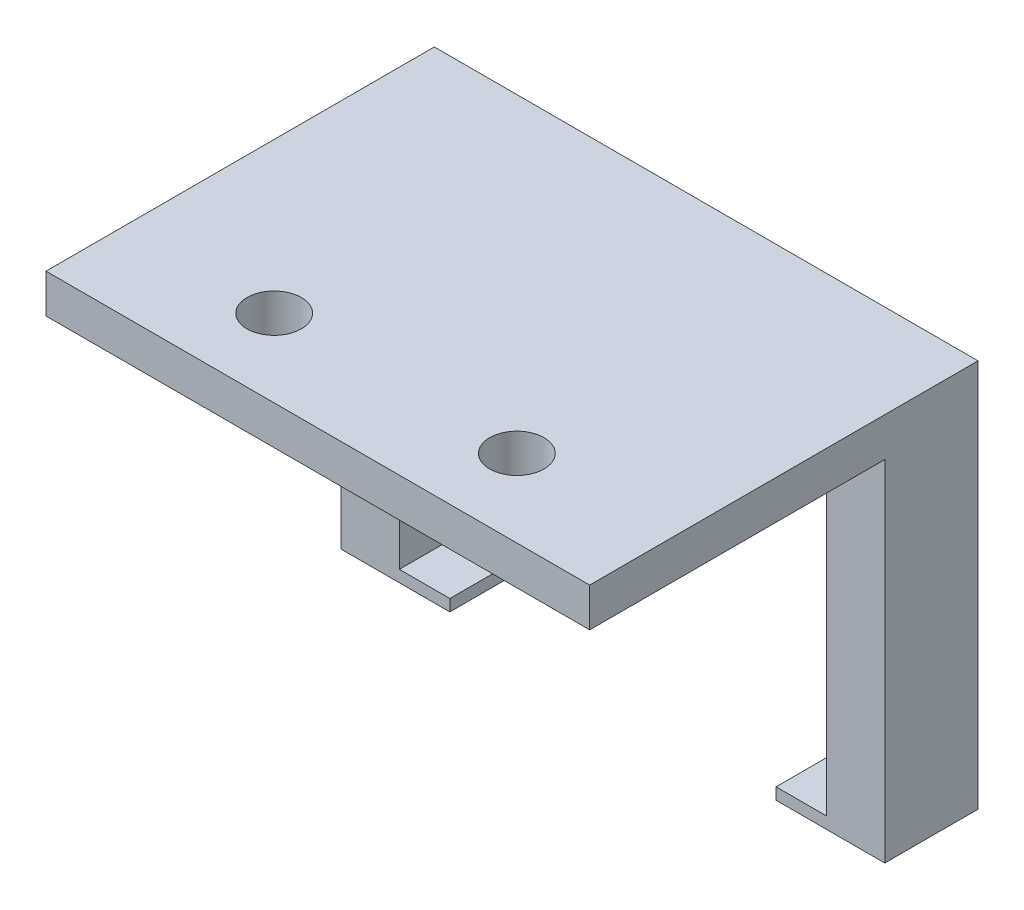
ISO-10303-21;
HEADER;
FILE_DESCRIPTION(('STEP AP214'),'2;1');
FILE_NAME('part.step','',(''),(''),'','','');
FILE_SCHEMA(('AUTOMOTIVE_DESIGN { 1 0 10303 214 1 1 1 1 }'));
ENDSEC;
DATA;
#1=APPLICATION_CONTEXT('core data for automotive mechanical design processes');
#2=APPLICATION_PROTOCOL_DEFINITION('international standard','automotive_design',2000,#1);
#3=PRODUCT_CONTEXT('',#1,'mechanical');
#4=PRODUCT('Part','Part','',(#3));
#5=PRODUCT_RELATED_PRODUCT_CATEGORY('part','',(#4));
#6=PRODUCT_DEFINITION_FORMATION('','',#4);
#7=PRODUCT_DEFINITION_CONTEXT('part definition',#1,'design');
#8=PRODUCT_DEFINITION('design','',#6,#7);
#9=PRODUCT_DEFINITION_SHAPE('','',#8);
#10=(LENGTH_UNIT() NAMED_UNIT(*) SI_UNIT(.MILLI.,.METRE.));
#11=(NAMED_UNIT(*) PLANE_ANGLE_UNIT() SI_UNIT($,.RADIAN.));
#12=(NAMED_UNIT(*) SI_UNIT($,.STERADIAN.) SOLID_ANGLE_UNIT());
#13=UNCERTAINTY_MEASURE_WITH_UNIT(LENGTH_MEASURE(1.E-05),#10,'distance_accuracy_value','');
#14=(GEOMETRIC_REPRESENTATION_CONTEXT(3) GLOBAL_UNCERTAINTY_ASSIGNED_CONTEXT((#13)) GLOBAL_UNIT_ASSIGNED_CONTEXT((#10,
#11,#12)) REPRESENTATION_CONTEXT('',''));
#15=CARTESIAN_POINT('',(0.,0.,0.));
#16=DIRECTION('',(0.,0.,1.));
#17=DIRECTION('',(1.,0.,0.));
#18=AXIS2_PLACEMENT_3D('',#15,#16,#17);
#19=CARTESIAN_POINT('',(20.2327480916031,-22.86,-1.29132824427481));
#20=DIRECTION('',(1.,0.,0.));
#21=DIRECTION('',(0.,0.,-1.));
#22=AXIS2_PLACEMENT_3D('',#19,#20,#21);
#23=PLANE('',#22);
#24=DIRECTION('',(0.,-1.,0.));
#25=VECTOR('',#24,1.);
#26=CARTESIAN_POINT('',(20.2327480916031,-22.86,-6.37132824427481));
#27=LINE('',#26,#25);
#28=CARTESIAN_POINT('',(20.2327480916031,0.,-6.37132824427481));
#29=VERTEX_POINT('',#28);
#30=CARTESIAN_POINT('',(20.2327480916031,-22.098,-6.37132824427481));
#31=VERTEX_POINT('',#30);
#32=EDGE_CURVE('E232',#29,#31,#27,.T.);
#33=ORIENTED_EDGE('',*,*,#32,.F.);
#34=DIRECTION('',(0.,0.,-1.));
#35=VECTOR('',#34,1.);
#36=CARTESIAN_POINT('',(20.2327480916031,0.,-1.29132824427481));
#37=LINE('',#36,#35);
#38=CARTESIAN_POINT('',(20.2327480916031,0.,-12.4673282442748));
#39=VERTEX_POINT('',#38);
#40=EDGE_CURVE('E163',#29,#39,#37,.T.);
#41=ORIENTED_EDGE('',*,*,#40,.T.);
#42=DIRECTION('',(0.,1.,0.));
#43=VECTOR('',#42,1.);
#44=CARTESIAN_POINT('',(20.2327480916031,-22.86,-12.4673282442748));
#45=LINE('',#44,#43);
#46=CARTESIAN_POINT('',(20.2327480916031,-22.098,-12.4673282442748));
#47=VERTEX_POINT('',#46);
#48=EDGE_CURVE('E264',#47,#39,#45,.T.);
#49=ORIENTED_EDGE('',*,*,#48,.F.);
#50=DIRECTION('',(0.,0.,-1.));
#51=VECTOR('',#50,1.);
#52=CARTESIAN_POINT('',(20.2327480916031,-22.098,-12.4673282442748));
#53=LINE('',#52,#51);
#54=EDGE_CURVE('E240',#31,#47,#53,.T.);
#55=ORIENTED_EDGE('',*,*,#54,.F.);
#56=EDGE_LOOP('',(#33,#41,#49,#55));
#57=FACE_BOUND('',#56,.T.);
#58=ADVANCED_FACE('F37',(#57),#23,.F.);
#59=CARTESIAN_POINT('',(-7.70725190839694,-22.86,-1.29132824427481));
#60=DIRECTION('',(-1.,0.,0.));
#61=DIRECTION('',(0.,0.,1.));
#62=AXIS2_PLACEMENT_3D('',#59,#60,#61);
#63=PLANE('',#62);
#64=DIRECTION('',(0.,1.,0.));
#65=VECTOR('',#64,1.);
#66=CARTESIAN_POINT('',(-7.70725190839694,-22.86,-6.37132824427481));
#67=LINE('',#66,#65);
#68=CARTESIAN_POINT('',(-7.70725190839694,-22.098,-6.37132824427481));
#69=VERTEX_POINT('',#68);
#70=CARTESIAN_POINT('',(-7.70725190839694,0.,-6.37132824427481));
#71=VERTEX_POINT('',#70);
#72=EDGE_CURVE('E238',#69,#71,#67,.T.);
#73=ORIENTED_EDGE('',*,*,#72,.F.);
#74=DIRECTION('',(0.,0.,1.));
#75=VECTOR('',#74,1.);
#76=CARTESIAN_POINT('',(-7.70725190839694,-22.098,-1.29132824427482));
#77=LINE('',#76,#75);
#78=CARTESIAN_POINT('',(-7.70725190839694,-22.098,-12.4673282442748));
#79=VERTEX_POINT('',#78);
#80=EDGE_CURVE('E253',#79,#69,#77,.T.);
#81=ORIENTED_EDGE('',*,*,#80,.F.);
#82=DIRECTION('',(0.,1.,0.));
#83=VECTOR('',#82,1.);
#84=CARTESIAN_POINT('',(-7.70725190839694,-22.86,-12.4673282442748));
#85=LINE('',#84,#83);
#86=CARTESIAN_POINT('',(-7.70725190839694,0.,-12.4673282442748));
#87=VERTEX_POINT('',#86);
#88=EDGE_CURVE('E160',#79,#87,#85,.T.);
#89=ORIENTED_EDGE('',*,*,#88,.T.);
#90=DIRECTION('',(0.,0.,1.));
#91=VECTOR('',#90,1.);
#92=CARTESIAN_POINT('',(-7.70725190839694,0.,-1.29132824427481));
#93=LINE('',#92,#91);
#94=EDGE_CURVE('E158',#87,#71,#93,.T.);
#95=ORIENTED_EDGE('',*,*,#94,.T.);
#96=EDGE_LOOP('',(#73,#81,#89,#95));
#97=FACE_BOUND('',#96,.T.);
#98=ADVANCED_FACE('F302',(#97),#63,.F.);
#99=CARTESIAN_POINT('',(0.,-22.86,0.));
#100=DIRECTION('',(0.,-1.,0.));
#101=DIRECTION('',(0.,0.,-1.));
#102=AXIS2_PLACEMENT_3D('',#99,#100,#101);
#103=PLANE('',#102);
#104=DIRECTION('',(0.,0.,-1.));
#105=VECTOR('',#104,1.);
#106=CARTESIAN_POINT('',(-4.40525190839694,-22.86,-1.29132824427482));
#107=LINE('',#106,#105);
#108=CARTESIAN_POINT('',(-4.40525190839694,-22.86,-6.37132824427481));
#109=VERTEX_POINT('',#108);
#110=CARTESIAN_POINT('',(-4.40525190839694,-22.86,-12.4673282442748));
#111=VERTEX_POINT('',#110);
#112=EDGE_CURVE('E150',#109,#111,#107,.T.);
#113=ORIENTED_EDGE('',*,*,#112,.F.);
#114=DIRECTION('',(1.,0.,0.));
#115=VECTOR('',#114,1.);
#116=CARTESIAN_POINT('',(-11.5172519083969,-22.86,-6.37132824427481));
#117=LINE('',#116,#115);
#118=CARTESIAN_POINT('',(-11.5172519083969,-22.86,-6.37132824427481));
#119=VERTEX_POINT('',#118);
#120=EDGE_CURVE('E52',#119,#109,#117,.T.);
#121=ORIENTED_EDGE('',*,*,#120,.F.);
#122=DIRECTION('',(0.,0.,-1.));
#123=VECTOR('',#122,1.);
#124=CARTESIAN_POINT('',(-11.5172519083969,-22.86,-1.29132824427481));
#125=LINE('',#124,#123);
#126=CARTESIAN_POINT('',(-11.5172519083969,-22.86,-12.4673282442748));
#127=VERTEX_POINT('',#126);
#128=EDGE_CURVE('E148',#119,#127,#125,.T.);
#129=ORIENTED_EDGE('',*,*,#128,.T.);
#130=DIRECTION('',(1.,0.,0.));
#131=VECTOR('',#130,1.);
#132=CARTESIAN_POINT('',(-11.5172519083969,-22.86,-12.4673282442748));
#133=LINE('',#132,#131);
#134=EDGE_CURVE('E157',#127,#111,#133,.T.);
#135=ORIENTED_EDGE('',*,*,#134,.T.);
#136=EDGE_LOOP('',(#113,#121,#129,#135));
#137=FACE_BOUND('',#136,.T.);
#138=ADVANCED_FACE('F146',(#137),#103,.T.);
#139=CARTESIAN_POINT('',(0.,-22.86,0.));
#140=DIRECTION('',(0.,1.,0.));
#141=DIRECTION('',(0.,0.,1.));
#142=AXIS2_PLACEMENT_3D('',#139,#140,#141);
#143=PLANE('',#142);
#144=CARTESIAN_POINT('',(16.9307480916031,-22.86,-6.37132824427481));
#145=VERTEX_POINT('',#144);
#146=CARTESIAN_POINT('',(24.0427480916031,-22.86,-6.37132824427481));
#147=VERTEX_POINT('',#146);
#148=EDGE_CURVE('E142',#145,#147,#117,.T.);
#149=ORIENTED_EDGE('',*,*,#148,.F.);
#150=DIRECTION('',(0.,0.,1.));
#151=VECTOR('',#150,1.);
#152=CARTESIAN_POINT('',(16.9307480916031,-22.86,-12.4673282442748));
#153=LINE('',#152,#151);
#154=CARTESIAN_POINT('',(16.9307480916031,-22.86,-12.4673282442748));
#155=VERTEX_POINT('',#154);
#156=EDGE_CURVE('E244',#155,#145,#153,.T.);
#157=ORIENTED_EDGE('',*,*,#156,.F.);
#158=DIRECTION('',(1.,0.,0.));
#159=VECTOR('',#158,1.);
#160=CARTESIAN_POINT('',(24.0427480916031,-22.86,-12.4673282442748));
#161=LINE('',#160,#159);
#162=CARTESIAN_POINT('',(24.0427480916031,-22.86,-12.4673282442748));
#163=VERTEX_POINT('',#162);
#164=EDGE_CURVE('E267',#155,#163,#161,.T.);
#165=ORIENTED_EDGE('',*,*,#164,.T.);
#166=DIRECTION('',(0.,0.,1.));
#167=VECTOR('',#166,1.);
#168=CARTESIAN_POINT('',(24.0427480916031,-22.86,-1.29132824427481));
#169=LINE('',#168,#167);
#170=EDGE_CURVE('E166',#163,#147,#169,.T.);
#171=ORIENTED_EDGE('',*,*,#170,.T.);
#172=EDGE_LOOP('',(#149,#157,#165,#171));
#173=FACE_BOUND('',#172,.T.);
#174=ADVANCED_FACE('F271',(#173),#143,.F.);
#175=CARTESIAN_POINT('',(-4.40525190839694,-22.098,-1.29132824427482));
#176=DIRECTION('',(0.,-1.,0.));
#177=DIRECTION('',(0.,0.,-1.));
#178=AXIS2_PLACEMENT_3D('',#175,#176,#177);
#179=PLANE('',#178);
#180=DIRECTION('',(-1.,0.,0.));
#181=VECTOR('',#180,1.);
#182=CARTESIAN_POINT('',(-4.40525190839694,-22.098,-6.37132824427481));
#183=LINE('',#182,#181);
#184=CARTESIAN_POINT('',(-4.40525190839694,-22.098,-6.37132824427481));
#185=VERTEX_POINT('',#184);
#186=EDGE_CURVE('E236',#185,#69,#183,.T.);
#187=ORIENTED_EDGE('',*,*,#186,.F.);
#188=DIRECTION('',(0.,0.,1.));
#189=VECTOR('',#188,1.);
#190=CARTESIAN_POINT('',(-4.40525190839694,-22.098,-1.29132824427482));
#191=LINE('',#190,#189);
#192=CARTESIAN_POINT('',(-4.40525190839694,-22.098,-12.4673282442748));
#193=VERTEX_POINT('',#192);
#194=EDGE_CURVE('E257',#193,#185,#191,.T.);
#195=ORIENTED_EDGE('',*,*,#194,.F.);
#196=DIRECTION('',(-1.,0.,0.));
#197=VECTOR('',#196,1.);
#198=CARTESIAN_POINT('',(-4.40525190839694,-22.098,-12.4673282442748));
#199=LINE('',#198,#197);
#200=EDGE_CURVE('E260',#193,#79,#199,.T.);
#201=ORIENTED_EDGE('',*,*,#200,.T.);
#202=ORIENTED_EDGE('',*,*,#80,.T.);
#203=EDGE_LOOP('',(#187,#195,#201,#202));
#204=FACE_BOUND('',#203,.T.);
#205=ADVANCED_FACE('F312',(#204),#179,.F.);
#206=CARTESIAN_POINT('',(-4.40525190839694,0.,0.));
#207=DIRECTION('',(1.,0.,0.));
#208=DIRECTION('',(0.,0.,-1.));
#209=AXIS2_PLACEMENT_3D('',#206,#207,#208);
#210=PLANE('',#209);
#211=ORIENTED_EDGE('',*,*,#194,.T.);
#212=DIRECTION('',(0.,-1.,0.));
#213=VECTOR('',#212,1.);
#214=CARTESIAN_POINT('',(-4.40525190839694,0.,-6.37132824427481));
#215=LINE('',#214,#213);
#216=EDGE_CURVE('E234',#185,#109,#215,.T.);
#217=ORIENTED_EDGE('',*,*,#216,.T.);
#218=ORIENTED_EDGE('',*,*,#112,.T.);
#219=DIRECTION('',(0.,1.,0.));
#220=VECTOR('',#219,1.);
#221=CARTESIAN_POINT('',(-4.40525190839694,-22.098,-12.4673282442748));
#222=LINE('',#221,#220);
#223=EDGE_CURVE('E255',#111,#193,#222,.T.);
#224=ORIENTED_EDGE('',*,*,#223,.T.);
#225=EDGE_LOOP('',(#211,#217,#218,#224));
#226=FACE_BOUND('',#225,.T.);
#227=ADVANCED_FACE('F404',(#226),#210,.T.);
#228=CARTESIAN_POINT('',(16.9307480916031,-22.098,-12.4673282442748));
#229=DIRECTION('',(0.,-1.,0.));
#230=DIRECTION('',(0.,0.,-1.));
#231=AXIS2_PLACEMENT_3D('',#228,#229,#230);
#232=PLANE('',#231);
#233=DIRECTION('',(-1.,0.,0.));
#234=VECTOR('',#233,1.);
#235=CARTESIAN_POINT('',(16.9307480916031,-22.098,-6.37132824427481));
#236=LINE('',#235,#234);
#237=CARTESIAN_POINT('',(16.9307480916031,-22.098,-6.37132824427481));
#238=VERTEX_POINT('',#237);
#239=EDGE_CURVE('E60',#31,#238,#236,.T.);
#240=ORIENTED_EDGE('',*,*,#239,.F.);
#241=ORIENTED_EDGE('',*,*,#54,.T.);
#242=DIRECTION('',(1.,0.,0.));
#243=VECTOR('',#242,1.);
#244=CARTESIAN_POINT('',(16.9307480916031,-22.098,-12.4673282442748));
#245=LINE('',#244,#243);
#246=CARTESIAN_POINT('',(16.9307480916031,-22.098,-12.4673282442748));
#247=VERTEX_POINT('',#246);
#248=EDGE_CURVE('E249',#247,#47,#245,.T.);
#249=ORIENTED_EDGE('',*,*,#248,.F.);
#250=DIRECTION('',(0.,0.,-1.));
#251=VECTOR('',#250,1.);
#252=CARTESIAN_POINT('',(16.9307480916031,-22.098,-12.4673282442748));
#253=LINE('',#252,#251);
#254=EDGE_CURVE('E247',#238,#247,#253,.T.);
#255=ORIENTED_EDGE('',*,*,#254,.F.);
#256=EDGE_LOOP('',(#240,#241,#249,#255));
#257=FACE_BOUND('',#256,.T.);
#258=ADVANCED_FACE('F297',(#257),#232,.F.);
#259=CARTESIAN_POINT('',(16.9307480916031,0.,0.));
#260=DIRECTION('',(-1.,0.,0.));
#261=DIRECTION('',(0.,0.,1.));
#262=AXIS2_PLACEMENT_3D('',#259,#260,#261);
#263=PLANE('',#262);
#264=ORIENTED_EDGE('',*,*,#156,.T.);
#265=DIRECTION('',(0.,1.,0.));
#266=VECTOR('',#265,1.);
#267=CARTESIAN_POINT('',(16.9307480916031,0.,-6.37132824427481));
#268=LINE('',#267,#266);
#269=EDGE_CURVE('E11',#145,#238,#268,.T.);
#270=ORIENTED_EDGE('',*,*,#269,.T.);
#271=ORIENTED_EDGE('',*,*,#254,.T.);
#272=DIRECTION('',(0.,-1.,0.));
#273=VECTOR('',#272,1.);
#274=CARTESIAN_POINT('',(16.9307480916031,-22.098,-12.4673282442748));
#275=LINE('',#274,#273);
#276=EDGE_CURVE('E241',#247,#155,#275,.T.);
#277=ORIENTED_EDGE('',*,*,#276,.T.);
#278=EDGE_LOOP('',(#264,#270,#271,#277));
#279=FACE_BOUND('',#278,.T.);
#280=ADVANCED_FACE('F292',(#279),#263,.T.);
#281=CARTESIAN_POINT('',(0.,0.,0.));
#282=DIRECTION('',(0.,1.,0.));
#283=DIRECTION('',(0.,0.,1.));
#284=AXIS2_PLACEMENT_3D('',#281,#282,#283);
#285=PLANE('',#284);
#286=ORIENTED_EDGE('',*,*,#40,.F.);
#287=DIRECTION('',(-1.,0.,0.));
#288=VECTOR('',#287,1.);
#289=CARTESIAN_POINT('',(-11.5172519083969,0.,-6.37132824427481));
#290=LINE('',#289,#288);
#291=CARTESIAN_POINT('',(24.0427480916031,0.,-6.37132824427481));
#292=VERTEX_POINT('',#291);
#293=EDGE_CURVE('E217',#292,#29,#290,.T.);
#294=ORIENTED_EDGE('',*,*,#293,.F.);
#295=DIRECTION('',(0.,0.,-1.));
#296=VECTOR('',#295,1.);
#297=CARTESIAN_POINT('',(24.0427480916031,0.,-12.4673282442748));
#298=LINE('',#297,#296);
#299=CARTESIAN_POINT('',(24.0427480916031,0.,12.9326717557252));
#300=VERTEX_POINT('',#299);
#301=EDGE_CURVE('E196',#300,#292,#298,.T.);
#302=ORIENTED_EDGE('',*,*,#301,.F.);
#303=DIRECTION('',(1.,0.,0.));
#304=VECTOR('',#303,1.);
#305=CARTESIAN_POINT('',(-11.5172519083969,0.,12.9326717557252));
#306=LINE('',#305,#304);
#307=CARTESIAN_POINT('',(-11.5172519083969,0.,12.9326717557252));
#308=VERTEX_POINT('',#307);
#309=EDGE_CURVE('E194',#308,#300,#306,.T.);
#310=ORIENTED_EDGE('',*,*,#309,.F.);
#311=DIRECTION('',(0.,0.,1.));
#312=VECTOR('',#311,1.);
#313=CARTESIAN_POINT('',(-11.5172519083969,0.,-12.4673282442748));
#314=LINE('',#313,#312);
#315=CARTESIAN_POINT('',(-11.5172519083969,0.,-6.37132824427481));
#316=VERTEX_POINT('',#315);
#317=EDGE_CURVE('E180',#316,#308,#314,.T.);
#318=ORIENTED_EDGE('',*,*,#317,.F.);
#319=EDGE_CURVE('E139',#71,#316,#290,.T.);
#320=ORIENTED_EDGE('',*,*,#319,.F.);
#321=ORIENTED_EDGE('',*,*,#94,.F.);
#322=DIRECTION('',(-1.,0.,0.));
#323=VECTOR('',#322,1.);
#324=CARTESIAN_POINT('',(-11.5172519083969,0.,-12.4673282442748));
#325=LINE('',#324,#323);
#326=EDGE_CURVE('E187',#39,#87,#325,.T.);
#327=ORIENTED_EDGE('',*,*,#326,.F.);
#328=EDGE_LOOP('',(#286,#294,#302,#310,#318,#320,#321,#327));
#329=FACE_BOUND('',#328,.T.);
#330=CARTESIAN_POINT('',(-1.67475190839694,0.,7.85267175572519));
#331=DIRECTION('',(0.,1.,0.));
#332=DIRECTION('',(0.,0.,1.));
#333=AXIS2_PLACEMENT_3D('',#330,#331,#332);
#334=CIRCLE('',#333,1.778);
#335=CARTESIAN_POINT('',(-1.67475190839694,0.,9.63067175572519));
#336=VERTEX_POINT('',#335);
#337=EDGE_CURVE('E174',#336,#336,#334,.T.);
#338=ORIENTED_EDGE('',*,*,#337,.T.);
#339=EDGE_LOOP('',(#338));
#340=FACE_BOUND('',#339,.T.);
#341=CARTESIAN_POINT('',(14.2002480916031,0.,7.85267175572519));
#342=DIRECTION('',(0.,1.,0.));
#343=DIRECTION('',(0.,0.,1.));
#344=AXIS2_PLACEMENT_3D('',#341,#342,#343);
#345=CIRCLE('',#344,1.778);
#346=CARTESIAN_POINT('',(14.2002480916031,0.,9.6306717557252));
#347=VERTEX_POINT('',#346);
#348=EDGE_CURVE('E170',#347,#347,#345,.T.);
#349=ORIENTED_EDGE('',*,*,#348,.T.);
#350=EDGE_LOOP('',(#349));
#351=FACE_BOUND('',#350,.T.);
#352=ADVANCED_FACE('F214',(#329,#340,#351),#285,.F.);
#353=CARTESIAN_POINT('',(0.,2.54,0.));
#354=DIRECTION('',(0.,1.,0.));
#355=DIRECTION('',(0.,0.,1.));
#356=AXIS2_PLACEMENT_3D('',#353,#354,#355);
#357=PLANE('',#356);
#358=CARTESIAN_POINT('',(-1.67475190839694,2.54,7.85267175572519));
#359=DIRECTION('',(0.,1.,0.));
#360=DIRECTION('',(0.,0.,1.));
#361=AXIS2_PLACEMENT_3D('',#358,#359,#360);
#362=CIRCLE('',#361,1.778);
#363=CARTESIAN_POINT('',(-1.67475190839694,2.54,9.63067175572519));
#364=VERTEX_POINT('',#363);
#365=EDGE_CURVE('E177',#364,#364,#362,.T.);
#366=ORIENTED_EDGE('',*,*,#365,.F.);
#367=EDGE_LOOP('',(#366));
#368=FACE_BOUND('',#367,.T.);
#369=DIRECTION('',(0.,0.,1.));
#370=VECTOR('',#369,1.);
#371=CARTESIAN_POINT('',(-11.5172519083969,2.54,-12.4673282442748));
#372=LINE('',#371,#370);
#373=CARTESIAN_POINT('',(-11.5172519083969,2.54,-12.4673282442748));
#374=VERTEX_POINT('',#373);
#375=CARTESIAN_POINT('',(-11.5172519083969,2.54,12.9326717557252));
#376=VERTEX_POINT('',#375);
#377=EDGE_CURVE('E183',#374,#376,#372,.T.);
#378=ORIENTED_EDGE('',*,*,#377,.T.);
#379=DIRECTION('',(1.,0.,0.));
#380=VECTOR('',#379,1.);
#381=CARTESIAN_POINT('',(-11.5172519083969,2.54,12.9326717557252));
#382=LINE('',#381,#380);
#383=CARTESIAN_POINT('',(24.0427480916031,2.54,12.9326717557252));
#384=VERTEX_POINT('',#383);
#385=EDGE_CURVE('E186',#376,#384,#382,.T.);
#386=ORIENTED_EDGE('',*,*,#385,.T.);
#387=DIRECTION('',(0.,0.,-1.));
#388=VECTOR('',#387,1.);
#389=CARTESIAN_POINT('',(24.0427480916031,2.54,-12.4673282442748));
#390=LINE('',#389,#388);
#391=CARTESIAN_POINT('',(24.0427480916031,2.54,-12.4673282442748));
#392=VERTEX_POINT('',#391);
#393=EDGE_CURVE('E189',#384,#392,#390,.T.);
#394=ORIENTED_EDGE('',*,*,#393,.T.);
#395=DIRECTION('',(-1.,0.,0.));
#396=VECTOR('',#395,1.);
#397=CARTESIAN_POINT('',(-11.5172519083969,2.54,-12.4673282442748));
#398=LINE('',#397,#396);
#399=EDGE_CURVE('E191',#392,#374,#398,.T.);
#400=ORIENTED_EDGE('',*,*,#399,.T.);
#401=EDGE_LOOP('',(#378,#386,#394,#400));
#402=FACE_BOUND('',#401,.T.);
#403=CARTESIAN_POINT('',(14.2002480916031,2.54,7.85267175572519));
#404=DIRECTION('',(0.,1.,0.));
#405=DIRECTION('',(0.,0.,1.));
#406=AXIS2_PLACEMENT_3D('',#403,#404,#405);
#407=CIRCLE('',#406,1.778);
#408=CARTESIAN_POINT('',(14.2002480916031,2.54,9.6306717557252));
#409=VERTEX_POINT('',#408);
#410=EDGE_CURVE('E171',#409,#409,#407,.T.);
#411=ORIENTED_EDGE('',*,*,#410,.F.);
#412=EDGE_LOOP('',(#411));
#413=FACE_BOUND('',#412,.T.);
#414=ADVANCED_FACE('F277',(#368,#402,#413),#357,.T.);
#415=CARTESIAN_POINT('',(-11.5172519083969,2.54,-12.4673282442748));
#416=DIRECTION('',(1.,0.,0.));
#417=DIRECTION('',(0.,0.,-1.));
#418=AXIS2_PLACEMENT_3D('',#415,#416,#417);
#419=PLANE('',#418);
#420=DIRECTION('',(0.,-1.,0.));
#421=VECTOR('',#420,1.);
#422=CARTESIAN_POINT('',(-11.5172519083969,0.,-6.37132824427481));
#423=LINE('',#422,#421);
#424=EDGE_CURVE('E136',#316,#119,#423,.T.);
#425=ORIENTED_EDGE('',*,*,#424,.F.);
#426=ORIENTED_EDGE('',*,*,#317,.T.);
#427=DIRECTION('',(0.,-1.,0.));
#428=VECTOR('',#427,1.);
#429=CARTESIAN_POINT('',(-11.5172519083969,2.54,12.9326717557252));
#430=LINE('',#429,#428);
#431=EDGE_CURVE('E45',#376,#308,#430,.T.);
#432=ORIENTED_EDGE('',*,*,#431,.F.);
#433=ORIENTED_EDGE('',*,*,#377,.F.);
#434=DIRECTION('',(0.,-1.,0.));
#435=VECTOR('',#434,1.);
#436=CARTESIAN_POINT('',(-11.5172519083969,2.54,-12.4673282442748));
#437=LINE('',#436,#435);
#438=EDGE_CURVE('E155',#374,#127,#437,.T.);
#439=ORIENTED_EDGE('',*,*,#438,.T.);
#440=ORIENTED_EDGE('',*,*,#128,.F.);
#441=EDGE_LOOP('',(#425,#426,#432,#433,#439,#440));
#442=FACE_BOUND('',#441,.T.);
#443=ADVANCED_FACE('F39',(#442),#419,.F.);
#444=CARTESIAN_POINT('',(-11.5172519083969,2.54,12.9326717557252));
#445=DIRECTION('',(0.,0.,-1.));
#446=DIRECTION('',(-1.,0.,0.));
#447=AXIS2_PLACEMENT_3D('',#444,#445,#446);
#448=PLANE('',#447);
#449=ORIENTED_EDGE('',*,*,#309,.T.);
#450=DIRECTION('',(0.,-1.,0.));
#451=VECTOR('',#450,1.);
#452=CARTESIAN_POINT('',(24.0427480916031,2.54,12.9326717557252));
#453=LINE('',#452,#451);
#454=EDGE_CURVE('E203',#384,#300,#453,.T.);
#455=ORIENTED_EDGE('',*,*,#454,.F.);
#456=ORIENTED_EDGE('',*,*,#385,.F.);
#457=ORIENTED_EDGE('',*,*,#431,.T.);
#458=EDGE_LOOP('',(#449,#455,#456,#457));
#459=FACE_BOUND('',#458,.T.);
#460=ADVANCED_FACE('F208',(#459),#448,.F.);
#461=CARTESIAN_POINT('',(24.0427480916031,2.54,-12.4673282442748));
#462=DIRECTION('',(-1.,0.,0.));
#463=DIRECTION('',(0.,0.,1.));
#464=AXIS2_PLACEMENT_3D('',#461,#462,#463);
#465=PLANE('',#464);
#466=ORIENTED_EDGE('',*,*,#301,.T.);
#467=DIRECTION('',(0.,1.,0.));
#468=VECTOR('',#467,1.);
#469=CARTESIAN_POINT('',(24.0427480916031,0.,-6.37132824427481));
#470=LINE('',#469,#468);
#471=EDGE_CURVE('E151',#147,#292,#470,.T.);
#472=ORIENTED_EDGE('',*,*,#471,.F.);
#473=ORIENTED_EDGE('',*,*,#170,.F.);
#474=DIRECTION('',(0.,-1.,0.));
#475=VECTOR('',#474,1.);
#476=CARTESIAN_POINT('',(24.0427480916031,2.54,-12.4673282442748));
#477=LINE('',#476,#475);
#478=EDGE_CURVE('E201',#392,#163,#477,.T.);
#479=ORIENTED_EDGE('',*,*,#478,.F.);
#480=ORIENTED_EDGE('',*,*,#393,.F.);
#481=ORIENTED_EDGE('',*,*,#454,.T.);
#482=EDGE_LOOP('',(#466,#472,#473,#479,#480,#481));
#483=FACE_BOUND('',#482,.T.);
#484=ADVANCED_FACE('F221',(#483),#465,.F.);
#485=CARTESIAN_POINT('',(-11.5172519083969,2.54,-12.4673282442748));
#486=DIRECTION('',(0.,0.,1.));
#487=DIRECTION('',(1.,0.,0.));
#488=AXIS2_PLACEMENT_3D('',#485,#486,#487);
#489=PLANE('',#488);
#490=ORIENTED_EDGE('',*,*,#478,.T.);
#491=ORIENTED_EDGE('',*,*,#164,.F.);
#492=ORIENTED_EDGE('',*,*,#276,.F.);
#493=ORIENTED_EDGE('',*,*,#248,.T.);
#494=ORIENTED_EDGE('',*,*,#48,.T.);
#495=ORIENTED_EDGE('',*,*,#326,.T.);
#496=ORIENTED_EDGE('',*,*,#88,.F.);
#497=ORIENTED_EDGE('',*,*,#200,.F.);
#498=ORIENTED_EDGE('',*,*,#223,.F.);
#499=ORIENTED_EDGE('',*,*,#134,.F.);
#500=ORIENTED_EDGE('',*,*,#438,.F.);
#501=ORIENTED_EDGE('',*,*,#399,.F.);
#502=EDGE_LOOP('',(#490,#491,#492,#493,#494,#495,#496,#497,#498,#499,#500,#501));
#503=FACE_BOUND('',#502,.T.);
#504=ADVANCED_FACE('F275',(#503),#489,.F.);
#505=CARTESIAN_POINT('',(-1.67475190839694,2.54,7.85267175572519));
#506=DIRECTION('',(0.,-1.,0.));
#507=DIRECTION('',(0.,0.,-1.));
#508=AXIS2_PLACEMENT_3D('',#505,#506,#507);
#509=CYLINDRICAL_SURFACE('',#508,1.778);
#510=ORIENTED_EDGE('',*,*,#365,.T.);
#511=EDGE_LOOP('',(#510));
#512=FACE_BOUND('',#511,.T.);
#513=ORIENTED_EDGE('',*,*,#337,.F.);
#514=EDGE_LOOP('',(#513));
#515=FACE_BOUND('',#514,.T.);
#516=ADVANCED_FACE('F287',(#512,#515),#509,.F.);
#517=CARTESIAN_POINT('',(14.2002480916031,2.54,7.85267175572519));
#518=DIRECTION('',(0.,-1.,0.));
#519=DIRECTION('',(0.,0.,-1.));
#520=AXIS2_PLACEMENT_3D('',#517,#518,#519);
#521=CYLINDRICAL_SURFACE('',#520,1.778);
#522=ORIENTED_EDGE('',*,*,#410,.T.);
#523=EDGE_LOOP('',(#522));
#524=FACE_BOUND('',#523,.T.);
#525=ORIENTED_EDGE('',*,*,#348,.F.);
#526=EDGE_LOOP('',(#525));
#527=FACE_BOUND('',#526,.T.);
#528=ADVANCED_FACE('F284',(#524,#527),#521,.F.);
#529=CARTESIAN_POINT('',(0.,0.,-6.37132824427481));
#530=DIRECTION('',(0.,0.,1.));
#531=DIRECTION('',(1.,0.,0.));
#532=AXIS2_PLACEMENT_3D('',#529,#530,#531);
#533=PLANE('',#532);
#534=ORIENTED_EDGE('',*,*,#32,.T.);
#535=ORIENTED_EDGE('',*,*,#239,.T.);
#536=ORIENTED_EDGE('',*,*,#269,.F.);
#537=ORIENTED_EDGE('',*,*,#148,.T.);
#538=ORIENTED_EDGE('',*,*,#471,.T.);
#539=ORIENTED_EDGE('',*,*,#293,.T.);
#540=EDGE_LOOP('',(#534,#535,#536,#537,#538,#539));
#541=FACE_BOUND('',#540,.T.);
#542=ADVANCED_FACE('F225',(#541),#533,.T.);
#543=ORIENTED_EDGE('',*,*,#72,.T.);
#544=ORIENTED_EDGE('',*,*,#319,.T.);
#545=ORIENTED_EDGE('',*,*,#424,.T.);
#546=ORIENTED_EDGE('',*,*,#120,.T.);
#547=ORIENTED_EDGE('',*,*,#216,.F.);
#548=ORIENTED_EDGE('',*,*,#186,.T.);
#549=EDGE_LOOP('',(#543,#544,#545,#546,#547,#548));
#550=FACE_BOUND('',#549,.T.);
#551=ADVANCED_FACE('F137',(#550),#533,.T.);
#552=CLOSED_SHELL('',(#58,#98,#138,#174,#205,#227,#258,#280,#352,#414,#443,#460,#484,#504,#516,
#528,#542,#551));
#553=MANIFOLD_SOLID_BREP('B2',#552);
#554=ADVANCED_BREP_SHAPE_REPRESENTATION('',(#18,#553),#14);
#555=SHAPE_DEFINITION_REPRESENTATION(#9,#554);
ENDSEC;
END-ISO-10303-21;
